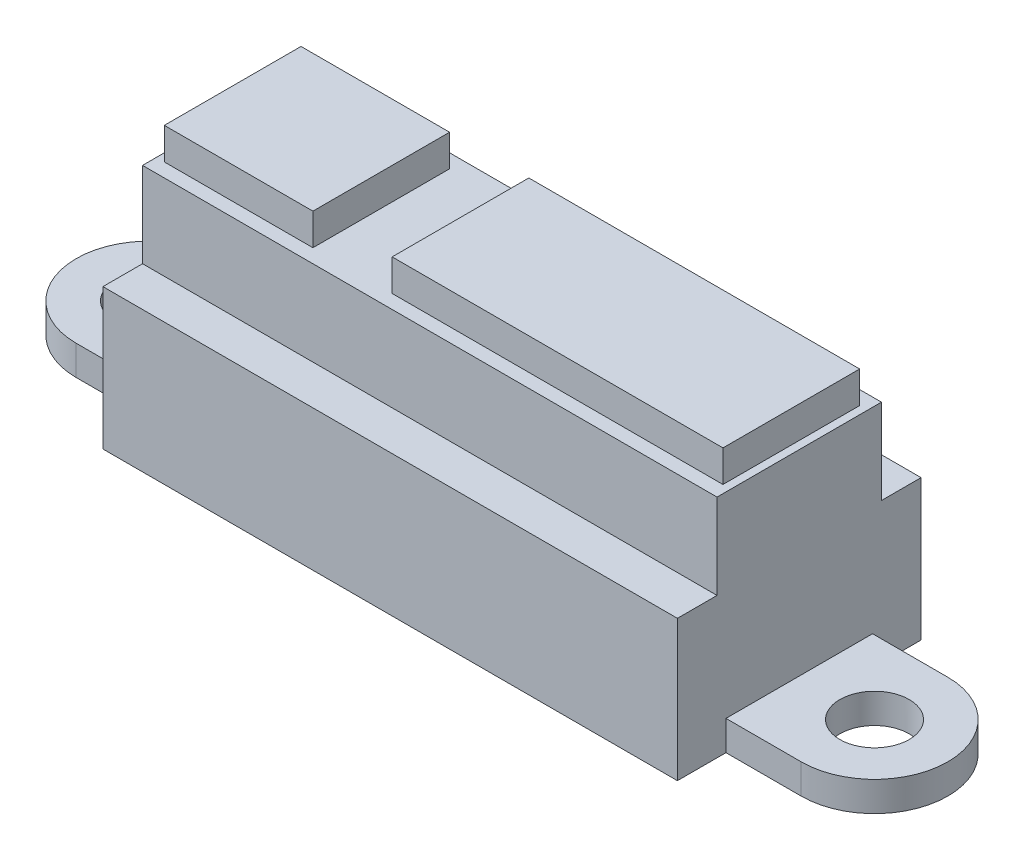
ISO-10303-21;
HEADER;
FILE_DESCRIPTION(('STEP AP214'),'2;1');
FILE_NAME('part.step','',(''),(''),'','','');
FILE_SCHEMA(('AUTOMOTIVE_DESIGN { 1 0 10303 214 1 1 1 1 }'));
ENDSEC;
DATA;
#1=APPLICATION_CONTEXT('core data for automotive mechanical design processes');
#2=APPLICATION_PROTOCOL_DEFINITION('international standard','automotive_design',2000,#1);
#3=PRODUCT_CONTEXT('',#1,'mechanical');
#4=PRODUCT('Part','Part','',(#3));
#5=PRODUCT_RELATED_PRODUCT_CATEGORY('part','',(#4));
#6=PRODUCT_DEFINITION_FORMATION('','',#4);
#7=PRODUCT_DEFINITION_CONTEXT('part definition',#1,'design');
#8=PRODUCT_DEFINITION('design','',#6,#7);
#9=PRODUCT_DEFINITION_SHAPE('','',#8);
#10=(LENGTH_UNIT() NAMED_UNIT(*) SI_UNIT(.MILLI.,.METRE.));
#11=(NAMED_UNIT(*) PLANE_ANGLE_UNIT() SI_UNIT($,.RADIAN.));
#12=(NAMED_UNIT(*) SI_UNIT($,.STERADIAN.) SOLID_ANGLE_UNIT());
#13=UNCERTAINTY_MEASURE_WITH_UNIT(LENGTH_MEASURE(1.E-05),#10,'distance_accuracy_value','');
#14=(GEOMETRIC_REPRESENTATION_CONTEXT(3) GLOBAL_UNCERTAINTY_ASSIGNED_CONTEXT((#13)) GLOBAL_UNIT_ASSIGNED_CONTEXT((#10,
#11,#12)) REPRESENTATION_CONTEXT('',''));
#15=CARTESIAN_POINT('',(0.,0.,0.));
#16=DIRECTION('',(0.,0.,1.));
#17=DIRECTION('',(1.,0.,0.));
#18=AXIS2_PLACEMENT_3D('',#15,#16,#17);
#19=CARTESIAN_POINT('',(22.,0.,12.3));
#20=DIRECTION('',(0.,1.,0.));
#21=DIRECTION('',(-1.,0.,0.));
#22=AXIS2_PLACEMENT_3D('',#19,#20,#21);
#23=PLANE('',#22);
#24=CARTESIAN_POINT('',(18.3,0.,6.15));
#25=DIRECTION('',(0.,1.,0.));
#26=DIRECTION('',(-1.,0.,0.));
#27=AXIS2_PLACEMENT_3D('',#24,#25,#26);
#28=CIRCLE('',#27,1.75);
#29=CARTESIAN_POINT('',(16.55,0.,6.15));
#30=VERTEX_POINT('',#29);
#31=EDGE_CURVE('E319',#30,#30,#28,.F.);
#32=ORIENTED_EDGE('',*,*,#31,.F.);
#33=EDGE_LOOP('',(#32));
#34=FACE_BOUND('',#33,.T.);
#35=DIRECTION('',(-1.,0.,0.));
#36=VECTOR('',#35,1.);
#37=CARTESIAN_POINT('',(22.,0.,9.84999999999999));
#38=LINE('',#37,#36);
#39=CARTESIAN_POINT('',(18.3,0.,9.85));
#40=VERTEX_POINT('',#39);
#41=CARTESIAN_POINT('',(14.5,0.,9.85));
#42=VERTEX_POINT('',#41);
#43=EDGE_CURVE('E320',#40,#42,#38,.T.);
#44=ORIENTED_EDGE('',*,*,#43,.T.);
#45=DIRECTION('',(0.,0.,1.));
#46=VECTOR('',#45,1.);
#47=CARTESIAN_POINT('',(14.5,0.,12.3));
#48=LINE('',#47,#46);
#49=CARTESIAN_POINT('',(14.5,0.,12.3));
#50=VERTEX_POINT('',#49);
#51=EDGE_CURVE('E367',#42,#50,#48,.T.);
#52=ORIENTED_EDGE('',*,*,#51,.T.);
#53=DIRECTION('',(1.,0.,0.));
#54=VECTOR('',#53,1.);
#55=CARTESIAN_POINT('',(-22.,0.,12.3));
#56=LINE('',#55,#54);
#57=CARTESIAN_POINT('',(-14.5,0.,12.3));
#58=VERTEX_POINT('',#57);
#59=EDGE_CURVE('E424',#58,#50,#56,.T.);
#60=ORIENTED_EDGE('',*,*,#59,.F.);
#61=DIRECTION('',(0.,0.,1.));
#62=VECTOR('',#61,1.);
#63=CARTESIAN_POINT('',(-14.5,0.,12.3));
#64=LINE('',#63,#62);
#65=CARTESIAN_POINT('',(-14.5,0.,9.85));
#66=VERTEX_POINT('',#65);
#67=EDGE_CURVE('E414',#66,#58,#64,.T.);
#68=ORIENTED_EDGE('',*,*,#67,.F.);
#69=DIRECTION('',(1.,0.,0.));
#70=VECTOR('',#69,1.);
#71=CARTESIAN_POINT('',(22.,0.,9.85000000000004));
#72=LINE('',#71,#70);
#73=CARTESIAN_POINT('',(-18.3,0.,9.85));
#74=VERTEX_POINT('',#73);
#75=EDGE_CURVE('E309',#74,#66,#72,.T.);
#76=ORIENTED_EDGE('',*,*,#75,.F.);
#77=CARTESIAN_POINT('',(-18.3,0.,6.15));
#78=DIRECTION('',(0.,1.,0.));
#79=DIRECTION('',(-1.,0.,0.));
#80=AXIS2_PLACEMENT_3D('',#77,#78,#79);
#81=CIRCLE('',#80,3.7);
#82=CARTESIAN_POINT('',(-18.3,0.,2.45));
#83=VERTEX_POINT('',#82);
#84=EDGE_CURVE('E311',#83,#74,#81,.T.);
#85=ORIENTED_EDGE('',*,*,#84,.F.);
#86=DIRECTION('',(1.,0.,0.));
#87=VECTOR('',#86,1.);
#88=CARTESIAN_POINT('',(22.,0.,2.4500000000001));
#89=LINE('',#88,#87);
#90=CARTESIAN_POINT('',(-14.5,0.,2.45000000000001));
#91=VERTEX_POINT('',#90);
#92=EDGE_CURVE('E404',#83,#91,#89,.T.);
#93=ORIENTED_EDGE('',*,*,#92,.T.);
#94=DIRECTION('',(0.,0.,-1.));
#95=VECTOR('',#94,1.);
#96=CARTESIAN_POINT('',(-14.5,0.,12.3));
#97=LINE('',#96,#95);
#98=CARTESIAN_POINT('',(-14.5,0.,0.));
#99=VERTEX_POINT('',#98);
#100=EDGE_CURVE('E401',#91,#99,#97,.T.);
#101=ORIENTED_EDGE('',*,*,#100,.T.);
#102=DIRECTION('',(1.,0.,0.));
#103=VECTOR('',#102,1.);
#104=CARTESIAN_POINT('',(22.,0.,0.));
#105=LINE('',#104,#103);
#106=CARTESIAN_POINT('',(14.5,0.,0.));
#107=VERTEX_POINT('',#106);
#108=EDGE_CURVE('E432',#99,#107,#105,.T.);
#109=ORIENTED_EDGE('',*,*,#108,.T.);
#110=DIRECTION('',(0.,0.,-1.));
#111=VECTOR('',#110,1.);
#112=CARTESIAN_POINT('',(14.5,0.,12.3));
#113=LINE('',#112,#111);
#114=CARTESIAN_POINT('',(14.5,0.,2.45));
#115=VERTEX_POINT('',#114);
#116=EDGE_CURVE('E387',#115,#107,#113,.T.);
#117=ORIENTED_EDGE('',*,*,#116,.F.);
#118=DIRECTION('',(-1.,0.,0.));
#119=VECTOR('',#118,1.);
#120=CARTESIAN_POINT('',(22.,0.,2.44999999999998));
#121=LINE('',#120,#119);
#122=CARTESIAN_POINT('',(18.3,0.,2.44999999999999));
#123=VERTEX_POINT('',#122);
#124=EDGE_CURVE('E391',#123,#115,#121,.T.);
#125=ORIENTED_EDGE('',*,*,#124,.F.);
#126=CARTESIAN_POINT('',(18.3,0.,6.15));
#127=DIRECTION('',(0.,1.,0.));
#128=DIRECTION('',(-1.,0.,0.));
#129=AXIS2_PLACEMENT_3D('',#126,#127,#128);
#130=CIRCLE('',#129,3.7);
#131=EDGE_CURVE('E393',#123,#40,#130,.F.);
#132=ORIENTED_EDGE('',*,*,#131,.T.);
#133=EDGE_LOOP('',(#44,#52,#60,#68,#76,#85,#93,#101,#109,#117,#125,#132));
#134=FACE_BOUND('',#133,.T.);
#135=CARTESIAN_POINT('',(-18.3,0.,6.15));
#136=DIRECTION('',(0.,1.,0.));
#137=DIRECTION('',(-1.,0.,0.));
#138=AXIS2_PLACEMENT_3D('',#135,#136,#137);
#139=CIRCLE('',#138,1.75);
#140=CARTESIAN_POINT('',(-20.05,0.,6.15));
#141=VERTEX_POINT('',#140);
#142=EDGE_CURVE('E321',#141,#141,#139,.T.);
#143=ORIENTED_EDGE('',*,*,#142,.T.);
#144=EDGE_LOOP('',(#143));
#145=FACE_BOUND('',#144,.T.);
#146=ADVANCED_FACE('F106',(#34,#134,#145),#23,.F.);
#147=CARTESIAN_POINT('',(14.5,1.50000000000001,12.3));
#148=DIRECTION('',(0.,-1.,0.));
#149=DIRECTION('',(1.,0.,0.));
#150=AXIS2_PLACEMENT_3D('',#147,#148,#149);
#151=PLANE('',#150);
#152=CARTESIAN_POINT('',(18.3,1.50000000000001,6.15));
#153=DIRECTION('',(0.,-1.,0.));
#154=DIRECTION('',(1.,0.,0.));
#155=AXIS2_PLACEMENT_3D('',#152,#153,#154);
#156=CIRCLE('',#155,1.75);
#157=CARTESIAN_POINT('',(20.05,1.50000000000001,6.15));
#158=VERTEX_POINT('',#157);
#159=EDGE_CURVE('E316',#158,#158,#156,.F.);
#160=ORIENTED_EDGE('',*,*,#159,.F.);
#161=EDGE_LOOP('',(#160));
#162=FACE_BOUND('',#161,.T.);
#163=DIRECTION('',(0.,0.,-1.));
#164=VECTOR('',#163,1.);
#165=CARTESIAN_POINT('',(14.5,1.50000000000001,12.3));
#166=LINE('',#165,#164);
#167=CARTESIAN_POINT('',(14.5,1.50000000000001,9.85));
#168=VERTEX_POINT('',#167);
#169=CARTESIAN_POINT('',(14.5,1.50000000000001,2.45));
#170=VERTEX_POINT('',#169);
#171=EDGE_CURVE('E294',#168,#170,#166,.T.);
#172=ORIENTED_EDGE('',*,*,#171,.F.);
#173=DIRECTION('',(1.,0.,0.));
#174=VECTOR('',#173,1.);
#175=CARTESIAN_POINT('',(14.5,1.50000000000001,9.85));
#176=LINE('',#175,#174);
#177=CARTESIAN_POINT('',(18.3,1.5,9.85));
#178=VERTEX_POINT('',#177);
#179=EDGE_CURVE('E372',#168,#178,#176,.T.);
#180=ORIENTED_EDGE('',*,*,#179,.T.);
#181=CARTESIAN_POINT('',(18.3,1.50000000000001,6.15));
#182=DIRECTION('',(0.,-1.,0.));
#183=DIRECTION('',(1.,0.,0.));
#184=AXIS2_PLACEMENT_3D('',#181,#182,#183);
#185=CIRCLE('',#184,3.7);
#186=CARTESIAN_POINT('',(18.3,1.5,2.44999999999999));
#187=VERTEX_POINT('',#186);
#188=EDGE_CURVE('E313',#178,#187,#185,.F.);
#189=ORIENTED_EDGE('',*,*,#188,.T.);
#190=DIRECTION('',(1.,0.,0.));
#191=VECTOR('',#190,1.);
#192=CARTESIAN_POINT('',(14.5,1.50000000000001,2.45));
#193=LINE('',#192,#191);
#194=EDGE_CURVE('E389',#170,#187,#193,.T.);
#195=ORIENTED_EDGE('',*,*,#194,.F.);
#196=EDGE_LOOP('',(#172,#180,#189,#195));
#197=FACE_BOUND('',#196,.T.);
#198=ADVANCED_FACE('F448',(#162,#197),#151,.F.);
#199=CARTESIAN_POINT('',(0.,0.,0.));
#200=DIRECTION('',(0.,0.,1.));
#201=DIRECTION('',(1.,0.,0.));
#202=AXIS2_PLACEMENT_3D('',#199,#200,#201);
#203=PLANE('',#202);
#204=DIRECTION('',(0.,-1.,0.));
#205=VECTOR('',#204,1.);
#206=CARTESIAN_POINT('',(-14.5,11.4,0.));
#207=LINE('',#206,#205);
#208=CARTESIAN_POINT('',(-14.5,7.1,0.));
#209=VERTEX_POINT('',#208);
#210=EDGE_CURVE('E340',#209,#99,#207,.T.);
#211=ORIENTED_EDGE('',*,*,#210,.F.);
#212=DIRECTION('',(-1.,0.,0.));
#213=VECTOR('',#212,1.);
#214=CARTESIAN_POINT('',(17.8,7.1,0.));
#215=LINE('',#214,#213);
#216=CARTESIAN_POINT('',(14.5,7.1,0.));
#217=VERTEX_POINT('',#216);
#218=EDGE_CURVE('E335',#217,#209,#215,.T.);
#219=ORIENTED_EDGE('',*,*,#218,.F.);
#220=DIRECTION('',(0.,1.,0.));
#221=VECTOR('',#220,1.);
#222=CARTESIAN_POINT('',(14.5,11.4,0.));
#223=LINE('',#222,#221);
#224=EDGE_CURVE('E129',#107,#217,#223,.T.);
#225=ORIENTED_EDGE('',*,*,#224,.F.);
#226=ORIENTED_EDGE('',*,*,#108,.F.);
#227=EDGE_LOOP('',(#211,#219,#225,#226));
#228=FACE_BOUND('',#227,.T.);
#229=ADVANCED_FACE('F339',(#228),#203,.F.);
#230=CARTESIAN_POINT('',(-14.5,1.5,12.3));
#231=DIRECTION('',(0.,-1.,0.));
#232=DIRECTION('',(1.,0.,0.));
#233=AXIS2_PLACEMENT_3D('',#230,#231,#232);
#234=PLANE('',#233);
#235=CARTESIAN_POINT('',(-18.3,1.5,6.15));
#236=DIRECTION('',(0.,-1.,0.));
#237=DIRECTION('',(1.,0.,0.));
#238=AXIS2_PLACEMENT_3D('',#235,#236,#237);
#239=CIRCLE('',#238,1.75);
#240=CARTESIAN_POINT('',(-16.55,1.5,6.15));
#241=VERTEX_POINT('',#240);
#242=EDGE_CURVE('E324',#241,#241,#239,.T.);
#243=ORIENTED_EDGE('',*,*,#242,.T.);
#244=EDGE_LOOP('',(#243));
#245=FACE_BOUND('',#244,.T.);
#246=DIRECTION('',(-1.,0.,0.));
#247=VECTOR('',#246,1.);
#248=CARTESIAN_POINT('',(-14.5,1.5,2.45000000000001));
#249=LINE('',#248,#247);
#250=CARTESIAN_POINT('',(-14.5,1.5,2.45000000000001));
#251=VERTEX_POINT('',#250);
#252=CARTESIAN_POINT('',(-18.3,1.5,2.45));
#253=VERTEX_POINT('',#252);
#254=EDGE_CURVE('E407',#251,#253,#249,.T.);
#255=ORIENTED_EDGE('',*,*,#254,.T.);
#256=CARTESIAN_POINT('',(-18.3,1.5,6.15));
#257=DIRECTION('',(0.,-1.,0.));
#258=DIRECTION('',(1.,0.,0.));
#259=AXIS2_PLACEMENT_3D('',#256,#257,#258);
#260=CIRCLE('',#259,3.7);
#261=CARTESIAN_POINT('',(-18.3,1.5,9.85));
#262=VERTEX_POINT('',#261);
#263=EDGE_CURVE('E420',#262,#253,#260,.T.);
#264=ORIENTED_EDGE('',*,*,#263,.F.);
#265=DIRECTION('',(-1.,0.,0.));
#266=VECTOR('',#265,1.);
#267=CARTESIAN_POINT('',(-14.5,1.5,9.85));
#268=LINE('',#267,#266);
#269=CARTESIAN_POINT('',(-14.5,1.5,9.85));
#270=VERTEX_POINT('',#269);
#271=EDGE_CURVE('E418',#270,#262,#268,.T.);
#272=ORIENTED_EDGE('',*,*,#271,.F.);
#273=DIRECTION('',(0.,0.,-1.));
#274=VECTOR('',#273,1.);
#275=CARTESIAN_POINT('',(-14.5,1.5,12.3));
#276=LINE('',#275,#274);
#277=EDGE_CURVE('E289',#270,#251,#276,.T.);
#278=ORIENTED_EDGE('',*,*,#277,.T.);
#279=EDGE_LOOP('',(#255,#264,#272,#278));
#280=FACE_BOUND('',#279,.T.);
#281=ADVANCED_FACE('F466',(#245,#280),#234,.F.);
#282=CARTESIAN_POINT('',(0.,0.,12.3));
#283=DIRECTION('',(0.,0.,1.));
#284=DIRECTION('',(1.,0.,0.));
#285=AXIS2_PLACEMENT_3D('',#282,#283,#284);
#286=PLANE('',#285);
#287=DIRECTION('',(-1.,0.,0.));
#288=VECTOR('',#287,1.);
#289=CARTESIAN_POINT('',(17.8,7.10000000000001,12.3));
#290=LINE('',#289,#288);
#291=CARTESIAN_POINT('',(14.5,7.10000000000001,12.3));
#292=VERTEX_POINT('',#291);
#293=CARTESIAN_POINT('',(-14.5,7.10000000000001,12.3));
#294=VERTEX_POINT('',#293);
#295=EDGE_CURVE('E475',#292,#294,#290,.T.);
#296=ORIENTED_EDGE('',*,*,#295,.T.);
#297=DIRECTION('',(0.,-1.,0.));
#298=VECTOR('',#297,1.);
#299=CARTESIAN_POINT('',(-14.5,11.4,12.3));
#300=LINE('',#299,#298);
#301=EDGE_CURVE('E422',#294,#58,#300,.T.);
#302=ORIENTED_EDGE('',*,*,#301,.T.);
#303=ORIENTED_EDGE('',*,*,#59,.T.);
#304=DIRECTION('',(0.,1.,0.));
#305=VECTOR('',#304,1.);
#306=CARTESIAN_POINT('',(14.5,11.4,12.3));
#307=LINE('',#306,#305);
#308=EDGE_CURVE('E427',#50,#292,#307,.T.);
#309=ORIENTED_EDGE('',*,*,#308,.T.);
#310=EDGE_LOOP('',(#296,#302,#303,#309));
#311=FACE_BOUND('',#310,.T.);
#312=ADVANCED_FACE('F474',(#311),#286,.T.);
#313=CARTESIAN_POINT('',(14.1,13.,12.3));
#314=DIRECTION('',(-1.,0.,0.));
#315=DIRECTION('',(0.,0.,1.));
#316=AXIS2_PLACEMENT_3D('',#313,#314,#315);
#317=PLANE('',#316);
#318=DIRECTION('',(0.,0.,-1.));
#319=VECTOR('',#318,1.);
#320=CARTESIAN_POINT('',(14.1,13.,12.3));
#321=LINE('',#320,#319);
#322=CARTESIAN_POINT('',(14.1,13.,9.6));
#323=VERTEX_POINT('',#322);
#324=CARTESIAN_POINT('',(14.1,13.,2.7));
#325=VERTEX_POINT('',#324);
#326=EDGE_CURVE('E307',#323,#325,#321,.T.);
#327=ORIENTED_EDGE('',*,*,#326,.F.);
#328=DIRECTION('',(0.,-1.,0.));
#329=VECTOR('',#328,1.);
#330=CARTESIAN_POINT('',(14.1,13.,9.6));
#331=LINE('',#330,#329);
#332=CARTESIAN_POINT('',(14.1,11.4,9.6));
#333=VERTEX_POINT('',#332);
#334=EDGE_CURVE('E498',#323,#333,#331,.T.);
#335=ORIENTED_EDGE('',*,*,#334,.T.);
#336=DIRECTION('',(0.,0.,-1.));
#337=VECTOR('',#336,1.);
#338=CARTESIAN_POINT('',(14.1,11.4,12.3));
#339=LINE('',#338,#337);
#340=CARTESIAN_POINT('',(14.1,11.4,2.7));
#341=VERTEX_POINT('',#340);
#342=EDGE_CURVE('E430',#333,#341,#339,.T.);
#343=ORIENTED_EDGE('',*,*,#342,.T.);
#344=DIRECTION('',(0.,1.,0.));
#345=VECTOR('',#344,1.);
#346=CARTESIAN_POINT('',(14.1,13.,2.7));
#347=LINE('',#346,#345);
#348=EDGE_CURVE('E360',#341,#325,#347,.T.);
#349=ORIENTED_EDGE('',*,*,#348,.T.);
#350=EDGE_LOOP('',(#327,#335,#343,#349));
#351=FACE_BOUND('',#350,.T.);
#352=ADVANCED_FACE('F108',(#351),#317,.F.);
#353=CARTESIAN_POINT('',(-2.6,13.,12.3));
#354=DIRECTION('',(0.,-1.,0.));
#355=DIRECTION('',(1.,0.,0.));
#356=AXIS2_PLACEMENT_3D('',#353,#354,#355);
#357=PLANE('',#356);
#358=DIRECTION('',(0.,0.,-1.));
#359=VECTOR('',#358,1.);
#360=CARTESIAN_POINT('',(-2.6,13.,12.3));
#361=LINE('',#360,#359);
#362=CARTESIAN_POINT('',(-2.6,13.,9.6));
#363=VERTEX_POINT('',#362);
#364=CARTESIAN_POINT('',(-2.6,13.,2.7));
#365=VERTEX_POINT('',#364);
#366=EDGE_CURVE('E305',#363,#365,#361,.T.);
#367=ORIENTED_EDGE('',*,*,#366,.F.);
#368=DIRECTION('',(-1.,0.,0.));
#369=VECTOR('',#368,1.);
#370=CARTESIAN_POINT('',(17.8,13.,9.6));
#371=LINE('',#370,#369);
#372=EDGE_CURVE('E490',#323,#363,#371,.T.);
#373=ORIENTED_EDGE('',*,*,#372,.F.);
#374=ORIENTED_EDGE('',*,*,#326,.T.);
#375=DIRECTION('',(-1.,0.,0.));
#376=VECTOR('',#375,1.);
#377=CARTESIAN_POINT('',(17.8,13.,2.7));
#378=LINE('',#377,#376);
#379=EDGE_CURVE('E351',#325,#365,#378,.T.);
#380=ORIENTED_EDGE('',*,*,#379,.T.);
#381=EDGE_LOOP('',(#367,#373,#374,#380));
#382=FACE_BOUND('',#381,.T.);
#383=ADVANCED_FACE('F527',(#382),#357,.F.);
#384=CARTESIAN_POINT('',(-2.6,11.4,12.3));
#385=DIRECTION('',(1.,0.,0.));
#386=DIRECTION('',(0.,0.,-1.));
#387=AXIS2_PLACEMENT_3D('',#384,#385,#386);
#388=PLANE('',#387);
#389=DIRECTION('',(0.,0.,-1.));
#390=VECTOR('',#389,1.);
#391=CARTESIAN_POINT('',(-2.6,11.4,12.3));
#392=LINE('',#391,#390);
#393=CARTESIAN_POINT('',(-2.6,11.4,9.6));
#394=VERTEX_POINT('',#393);
#395=CARTESIAN_POINT('',(-2.6,11.4,2.7));
#396=VERTEX_POINT('',#395);
#397=EDGE_CURVE('E303',#394,#396,#392,.T.);
#398=ORIENTED_EDGE('',*,*,#397,.F.);
#399=DIRECTION('',(0.,1.,0.));
#400=VECTOR('',#399,1.);
#401=CARTESIAN_POINT('',(-2.6,11.4,9.6));
#402=LINE('',#401,#400);
#403=EDGE_CURVE('E495',#394,#363,#402,.T.);
#404=ORIENTED_EDGE('',*,*,#403,.T.);
#405=ORIENTED_EDGE('',*,*,#366,.T.);
#406=DIRECTION('',(0.,-1.,0.));
#407=VECTOR('',#406,1.);
#408=CARTESIAN_POINT('',(-2.6,11.4,2.7));
#409=LINE('',#408,#407);
#410=EDGE_CURVE('E357',#365,#396,#409,.T.);
#411=ORIENTED_EDGE('',*,*,#410,.T.);
#412=EDGE_LOOP('',(#398,#404,#405,#411));
#413=FACE_BOUND('',#412,.T.);
#414=ADVANCED_FACE('F523',(#413),#388,.F.);
#415=CARTESIAN_POINT('',(-6.6,13.,12.3));
#416=DIRECTION('',(-1.,0.,0.));
#417=DIRECTION('',(0.,-1.,0.));
#418=AXIS2_PLACEMENT_3D('',#415,#416,#417);
#419=PLANE('',#418);
#420=DIRECTION('',(0.,0.,-1.));
#421=VECTOR('',#420,1.);
#422=CARTESIAN_POINT('',(-6.6,13.,12.3));
#423=LINE('',#422,#421);
#424=CARTESIAN_POINT('',(-6.6,13.,9.6));
#425=VERTEX_POINT('',#424);
#426=CARTESIAN_POINT('',(-6.6,13.,2.7));
#427=VERTEX_POINT('',#426);
#428=EDGE_CURVE('E299',#425,#427,#423,.T.);
#429=ORIENTED_EDGE('',*,*,#428,.F.);
#430=DIRECTION('',(0.,-1.,0.));
#431=VECTOR('',#430,1.);
#432=CARTESIAN_POINT('',(-6.6,13.,9.6));
#433=LINE('',#432,#431);
#434=CARTESIAN_POINT('',(-6.6,11.4,9.6));
#435=VERTEX_POINT('',#434);
#436=EDGE_CURVE('E481',#425,#435,#433,.T.);
#437=ORIENTED_EDGE('',*,*,#436,.T.);
#438=DIRECTION('',(0.,0.,-1.));
#439=VECTOR('',#438,1.);
#440=CARTESIAN_POINT('',(-6.6,11.4,12.3));
#441=LINE('',#440,#439);
#442=CARTESIAN_POINT('',(-6.6,11.4,2.7));
#443=VERTEX_POINT('',#442);
#444=EDGE_CURVE('E301',#435,#443,#441,.T.);
#445=ORIENTED_EDGE('',*,*,#444,.T.);
#446=DIRECTION('',(0.,1.,0.));
#447=VECTOR('',#446,1.);
#448=CARTESIAN_POINT('',(-6.6,13.,2.7));
#449=LINE('',#448,#447);
#450=EDGE_CURVE('E354',#443,#427,#449,.T.);
#451=ORIENTED_EDGE('',*,*,#450,.T.);
#452=EDGE_LOOP('',(#429,#437,#445,#451));
#453=FACE_BOUND('',#452,.T.);
#454=ADVANCED_FACE('F568',(#453),#419,.F.);
#455=CARTESIAN_POINT('',(-14.1,13.,12.3));
#456=DIRECTION('',(0.,-1.,0.));
#457=DIRECTION('',(0.,0.,-1.));
#458=AXIS2_PLACEMENT_3D('',#455,#456,#457);
#459=PLANE('',#458);
#460=DIRECTION('',(0.,0.,-1.));
#461=VECTOR('',#460,1.);
#462=CARTESIAN_POINT('',(-14.1,13.,12.3));
#463=LINE('',#462,#461);
#464=CARTESIAN_POINT('',(-14.1,13.,9.6));
#465=VERTEX_POINT('',#464);
#466=CARTESIAN_POINT('',(-14.1,13.,2.7));
#467=VERTEX_POINT('',#466);
#468=EDGE_CURVE('E291',#465,#467,#463,.T.);
#469=ORIENTED_EDGE('',*,*,#468,.F.);
#470=EDGE_CURVE('E491',#425,#465,#371,.T.);
#471=ORIENTED_EDGE('',*,*,#470,.F.);
#472=ORIENTED_EDGE('',*,*,#428,.T.);
#473=EDGE_CURVE('E503',#427,#467,#378,.T.);
#474=ORIENTED_EDGE('',*,*,#473,.T.);
#475=EDGE_LOOP('',(#469,#471,#472,#474));
#476=FACE_BOUND('',#475,.T.);
#477=ADVANCED_FACE('F564',(#476),#459,.F.);
#478=CARTESIAN_POINT('',(-14.1,13.,12.3));
#479=DIRECTION('',(1.,0.,0.));
#480=DIRECTION('',(0.,0.,-1.));
#481=AXIS2_PLACEMENT_3D('',#478,#479,#480);
#482=PLANE('',#481);
#483=DIRECTION('',(0.,0.,-1.));
#484=VECTOR('',#483,1.);
#485=CARTESIAN_POINT('',(-14.1,11.4,12.3));
#486=LINE('',#485,#484);
#487=CARTESIAN_POINT('',(-14.1,11.4,9.6));
#488=VERTEX_POINT('',#487);
#489=CARTESIAN_POINT('',(-14.1,11.4,2.7));
#490=VERTEX_POINT('',#489);
#491=EDGE_CURVE('E288',#488,#490,#486,.T.);
#492=ORIENTED_EDGE('',*,*,#491,.F.);
#493=DIRECTION('',(0.,1.,0.));
#494=VECTOR('',#493,1.);
#495=CARTESIAN_POINT('',(-14.1,13.,9.6));
#496=LINE('',#495,#494);
#497=EDGE_CURVE('E477',#488,#465,#496,.T.);
#498=ORIENTED_EDGE('',*,*,#497,.T.);
#499=ORIENTED_EDGE('',*,*,#468,.T.);
#500=DIRECTION('',(0.,-1.,0.));
#501=VECTOR('',#500,1.);
#502=CARTESIAN_POINT('',(-14.1,13.,2.7));
#503=LINE('',#502,#501);
#504=EDGE_CURVE('E350',#467,#490,#503,.T.);
#505=ORIENTED_EDGE('',*,*,#504,.T.);
#506=EDGE_LOOP('',(#492,#498,#499,#505));
#507=FACE_BOUND('',#506,.T.);
#508=ADVANCED_FACE('F561',(#507),#482,.F.);
#509=CARTESIAN_POINT('',(-14.5,11.4,12.3));
#510=DIRECTION('',(1.,0.,0.));
#511=DIRECTION('',(0.,0.,-1.));
#512=AXIS2_PLACEMENT_3D('',#509,#510,#511);
#513=PLANE('',#512);
#514=ORIENTED_EDGE('',*,*,#301,.F.);
#515=DIRECTION('',(0.,0.,1.));
#516=VECTOR('',#515,1.);
#517=CARTESIAN_POINT('',(-14.5,7.10000000000001,10.3));
#518=LINE('',#517,#516);
#519=CARTESIAN_POINT('',(-14.5,7.10000000000001,10.3));
#520=VERTEX_POINT('',#519);
#521=EDGE_CURVE('E282',#520,#294,#518,.T.);
#522=ORIENTED_EDGE('',*,*,#521,.F.);
#523=DIRECTION('',(0.,-1.,0.));
#524=VECTOR('',#523,1.);
#525=CARTESIAN_POINT('',(-14.5,11.4,10.3));
#526=LINE('',#525,#524);
#527=CARTESIAN_POINT('',(-14.5,11.4,10.3));
#528=VERTEX_POINT('',#527);
#529=EDGE_CURVE('E270',#528,#520,#526,.T.);
#530=ORIENTED_EDGE('',*,*,#529,.F.);
#531=DIRECTION('',(0.,0.,-1.));
#532=VECTOR('',#531,1.);
#533=CARTESIAN_POINT('',(-14.5,11.4,12.3));
#534=LINE('',#533,#532);
#535=CARTESIAN_POINT('',(-14.5,11.4,2.));
#536=VERTEX_POINT('',#535);
#537=EDGE_CURVE('E280',#528,#536,#534,.T.);
#538=ORIENTED_EDGE('',*,*,#537,.T.);
#539=DIRECTION('',(0.,1.,0.));
#540=VECTOR('',#539,1.);
#541=CARTESIAN_POINT('',(-14.5,11.4,2.));
#542=LINE('',#541,#540);
#543=CARTESIAN_POINT('',(-14.5,7.1,2.));
#544=VERTEX_POINT('',#543);
#545=EDGE_CURVE('E341',#544,#536,#542,.T.);
#546=ORIENTED_EDGE('',*,*,#545,.F.);
#547=DIRECTION('',(0.,0.,1.));
#548=VECTOR('',#547,1.);
#549=CARTESIAN_POINT('',(-14.5,7.1,2.));
#550=LINE('',#549,#548);
#551=EDGE_CURVE('E345',#209,#544,#550,.T.);
#552=ORIENTED_EDGE('',*,*,#551,.F.);
#553=ORIENTED_EDGE('',*,*,#210,.T.);
#554=ORIENTED_EDGE('',*,*,#100,.F.);
#555=DIRECTION('',(0.,1.,0.));
#556=VECTOR('',#555,1.);
#557=CARTESIAN_POINT('',(-14.5,-9.3,2.45000000000001));
#558=LINE('',#557,#556);
#559=EDGE_CURVE('E398',#91,#251,#558,.T.);
#560=ORIENTED_EDGE('',*,*,#559,.T.);
#561=ORIENTED_EDGE('',*,*,#277,.F.);
#562=DIRECTION('',(0.,1.,0.));
#563=VECTOR('',#562,1.);
#564=CARTESIAN_POINT('',(-14.5,-9.3,9.85));
#565=LINE('',#564,#563);
#566=EDGE_CURVE('E410',#66,#270,#565,.T.);
#567=ORIENTED_EDGE('',*,*,#566,.F.);
#568=ORIENTED_EDGE('',*,*,#67,.T.);
#569=EDGE_LOOP('',(#514,#522,#530,#538,#546,#552,#553,#554,#560,#561,#567,#568));
#570=FACE_BOUND('',#569,.T.);
#571=ADVANCED_FACE('F278',(#570),#513,.F.);
#572=CARTESIAN_POINT('',(14.5,11.4,12.3));
#573=DIRECTION('',(-1.,0.,0.));
#574=DIRECTION('',(0.,-1.,0.));
#575=AXIS2_PLACEMENT_3D('',#572,#573,#574);
#576=PLANE('',#575);
#577=DIRECTION('',(0.,-1.,0.));
#578=VECTOR('',#577,1.);
#579=CARTESIAN_POINT('',(14.5,11.4,10.3));
#580=LINE('',#579,#578);
#581=CARTESIAN_POINT('',(14.5,11.4,10.3));
#582=VERTEX_POINT('',#581);
#583=CARTESIAN_POINT('',(14.5,7.10000000000001,10.3));
#584=VERTEX_POINT('',#583);
#585=EDGE_CURVE('E121',#582,#584,#580,.T.);
#586=ORIENTED_EDGE('',*,*,#585,.T.);
#587=DIRECTION('',(0.,0.,1.));
#588=VECTOR('',#587,1.);
#589=CARTESIAN_POINT('',(14.5,7.10000000000001,12.3));
#590=LINE('',#589,#588);
#591=EDGE_CURVE('E12',#584,#292,#590,.T.);
#592=ORIENTED_EDGE('',*,*,#591,.T.);
#593=ORIENTED_EDGE('',*,*,#308,.F.);
#594=ORIENTED_EDGE('',*,*,#51,.F.);
#595=DIRECTION('',(0.,1.,0.));
#596=VECTOR('',#595,1.);
#597=CARTESIAN_POINT('',(14.5,-9.3,9.85));
#598=LINE('',#597,#596);
#599=EDGE_CURVE('E364',#42,#168,#598,.T.);
#600=ORIENTED_EDGE('',*,*,#599,.T.);
#601=ORIENTED_EDGE('',*,*,#171,.T.);
#602=DIRECTION('',(0.,1.,0.));
#603=VECTOR('',#602,1.);
#604=CARTESIAN_POINT('',(14.5,-9.3,2.45));
#605=LINE('',#604,#603);
#606=EDGE_CURVE('E384',#115,#170,#605,.T.);
#607=ORIENTED_EDGE('',*,*,#606,.F.);
#608=ORIENTED_EDGE('',*,*,#116,.T.);
#609=ORIENTED_EDGE('',*,*,#224,.T.);
#610=DIRECTION('',(0.,0.,1.));
#611=VECTOR('',#610,1.);
#612=CARTESIAN_POINT('',(14.5,7.1,12.3));
#613=LINE('',#612,#611);
#614=CARTESIAN_POINT('',(14.5,7.1,2.));
#615=VERTEX_POINT('',#614);
#616=EDGE_CURVE('E275',#217,#615,#613,.T.);
#617=ORIENTED_EDGE('',*,*,#616,.T.);
#618=DIRECTION('',(0.,1.,0.));
#619=VECTOR('',#618,1.);
#620=CARTESIAN_POINT('',(14.5,11.4,2.));
#621=LINE('',#620,#619);
#622=CARTESIAN_POINT('',(14.5,11.4,2.));
#623=VERTEX_POINT('',#622);
#624=EDGE_CURVE('E330',#615,#623,#621,.T.);
#625=ORIENTED_EDGE('',*,*,#624,.T.);
#626=DIRECTION('',(0.,0.,-1.));
#627=VECTOR('',#626,1.);
#628=CARTESIAN_POINT('',(14.5,11.4,12.3));
#629=LINE('',#628,#627);
#630=EDGE_CURVE('E437',#582,#623,#629,.T.);
#631=ORIENTED_EDGE('',*,*,#630,.F.);
#632=EDGE_LOOP('',(#586,#592,#593,#594,#600,#601,#607,#608,#609,#617,#625,#631));
#633=FACE_BOUND('',#632,.T.);
#634=ADVANCED_FACE('F329',(#633),#576,.F.);
#635=CARTESIAN_POINT('',(14.1,11.4,12.3));
#636=DIRECTION('',(0.,-1.,0.));
#637=DIRECTION('',(1.,0.,0.));
#638=AXIS2_PLACEMENT_3D('',#635,#636,#637);
#639=PLANE('',#638);
#640=ORIENTED_EDGE('',*,*,#342,.F.);
#641=DIRECTION('',(-1.,0.,0.));
#642=VECTOR('',#641,1.);
#643=CARTESIAN_POINT('',(17.8,11.4,9.6));
#644=LINE('',#643,#642);
#645=EDGE_CURVE('E483',#333,#394,#644,.T.);
#646=ORIENTED_EDGE('',*,*,#645,.T.);
#647=ORIENTED_EDGE('',*,*,#397,.T.);
#648=DIRECTION('',(-1.,0.,0.));
#649=VECTOR('',#648,1.);
#650=CARTESIAN_POINT('',(17.8,11.4,2.7));
#651=LINE('',#650,#649);
#652=EDGE_CURVE('E505',#341,#396,#651,.T.);
#653=ORIENTED_EDGE('',*,*,#652,.F.);
#654=EDGE_LOOP('',(#640,#646,#647,#653));
#655=FACE_BOUND('',#654,.T.);
#656=ORIENTED_EDGE('',*,*,#444,.F.);
#657=EDGE_CURVE('E487',#435,#488,#644,.T.);
#658=ORIENTED_EDGE('',*,*,#657,.T.);
#659=ORIENTED_EDGE('',*,*,#491,.T.);
#660=EDGE_CURVE('E343',#443,#490,#651,.T.);
#661=ORIENTED_EDGE('',*,*,#660,.F.);
#662=EDGE_LOOP('',(#656,#658,#659,#661));
#663=FACE_BOUND('',#662,.T.);
#664=DIRECTION('',(-1.,0.,0.));
#665=VECTOR('',#664,1.);
#666=CARTESIAN_POINT('',(14.1,11.4,2.));
#667=LINE('',#666,#665);
#668=EDGE_CURVE('E286',#623,#536,#667,.T.);
#669=ORIENTED_EDGE('',*,*,#668,.T.);
#670=ORIENTED_EDGE('',*,*,#537,.F.);
#671=DIRECTION('',(1.,0.,0.));
#672=VECTOR('',#671,1.);
#673=CARTESIAN_POINT('',(14.1,11.4,10.3));
#674=LINE('',#673,#672);
#675=EDGE_CURVE('E114',#528,#582,#674,.T.);
#676=ORIENTED_EDGE('',*,*,#675,.T.);
#677=ORIENTED_EDGE('',*,*,#630,.T.);
#678=EDGE_LOOP('',(#669,#670,#676,#677));
#679=FACE_BOUND('',#678,.T.);
#680=ADVANCED_FACE('F284',(#655,#663,#679),#639,.F.);
#681=CARTESIAN_POINT('',(-18.3,-9.3,6.15));
#682=DIRECTION('',(0.,1.,0.));
#683=DIRECTION('',(-1.,0.,0.));
#684=AXIS2_PLACEMENT_3D('',#681,#682,#683);
#685=CYLINDRICAL_SURFACE('',#684,3.7);
#686=ORIENTED_EDGE('',*,*,#263,.T.);
#687=DIRECTION('',(0.,1.,0.));
#688=VECTOR('',#687,1.);
#689=CARTESIAN_POINT('',(-18.3,-9.3,2.45));
#690=LINE('',#689,#688);
#691=EDGE_CURVE('E395',#83,#253,#690,.T.);
#692=ORIENTED_EDGE('',*,*,#691,.F.);
#693=ORIENTED_EDGE('',*,*,#84,.T.);
#694=DIRECTION('',(0.,1.,0.));
#695=VECTOR('',#694,1.);
#696=CARTESIAN_POINT('',(-18.3,-9.3,9.85));
#697=LINE('',#696,#695);
#698=EDGE_CURVE('E411',#74,#262,#697,.T.);
#699=ORIENTED_EDGE('',*,*,#698,.T.);
#700=EDGE_LOOP('',(#686,#692,#693,#699));
#701=FACE_BOUND('',#700,.T.);
#702=ADVANCED_FACE('F586',(#701),#685,.T.);
#703=CARTESIAN_POINT('',(0.,-9.3,9.85000000000002));
#704=DIRECTION('',(0.,0.,1.));
#705=DIRECTION('',(1.,0.,0.));
#706=AXIS2_PLACEMENT_3D('',#703,#704,#705);
#707=PLANE('',#706);
#708=ORIENTED_EDGE('',*,*,#271,.T.);
#709=ORIENTED_EDGE('',*,*,#698,.F.);
#710=ORIENTED_EDGE('',*,*,#75,.T.);
#711=ORIENTED_EDGE('',*,*,#566,.T.);
#712=EDGE_LOOP('',(#708,#709,#710,#711));
#713=FACE_BOUND('',#712,.T.);
#714=ADVANCED_FACE('F607',(#713),#707,.T.);
#715=CARTESIAN_POINT('',(0.,-9.3,2.45000000000004));
#716=DIRECTION('',(0.,0.,1.));
#717=DIRECTION('',(1.,0.,0.));
#718=AXIS2_PLACEMENT_3D('',#715,#716,#717);
#719=PLANE('',#718);
#720=ORIENTED_EDGE('',*,*,#559,.F.);
#721=ORIENTED_EDGE('',*,*,#92,.F.);
#722=ORIENTED_EDGE('',*,*,#691,.T.);
#723=ORIENTED_EDGE('',*,*,#254,.F.);
#724=EDGE_LOOP('',(#720,#721,#722,#723));
#725=FACE_BOUND('',#724,.T.);
#726=ADVANCED_FACE('F462',(#725),#719,.F.);
#727=CARTESIAN_POINT('',(18.3,-9.3,6.15));
#728=DIRECTION('',(0.,1.,0.));
#729=DIRECTION('',(-1.,0.,0.));
#730=AXIS2_PLACEMENT_3D('',#727,#728,#729);
#731=CYLINDRICAL_SURFACE('',#730,3.7);
#732=DIRECTION('',(0.,1.,0.));
#733=VECTOR('',#732,1.);
#734=CARTESIAN_POINT('',(18.3,-9.3,2.44999999999999));
#735=LINE('',#734,#733);
#736=EDGE_CURVE('E381',#123,#187,#735,.T.);
#737=ORIENTED_EDGE('',*,*,#736,.T.);
#738=ORIENTED_EDGE('',*,*,#188,.F.);
#739=DIRECTION('',(0.,1.,0.));
#740=VECTOR('',#739,1.);
#741=CARTESIAN_POINT('',(18.3,-9.3,9.85));
#742=LINE('',#741,#740);
#743=EDGE_CURVE('E363',#40,#178,#742,.T.);
#744=ORIENTED_EDGE('',*,*,#743,.F.);
#745=ORIENTED_EDGE('',*,*,#131,.F.);
#746=EDGE_LOOP('',(#737,#738,#744,#745));
#747=FACE_BOUND('',#746,.T.);
#748=ADVANCED_FACE('F451',(#747),#731,.T.);
#749=CARTESIAN_POINT('',(0.,-9.3,2.45000000000005));
#750=DIRECTION('',(0.,0.,-1.));
#751=DIRECTION('',(-1.,0.,0.));
#752=AXIS2_PLACEMENT_3D('',#749,#750,#751);
#753=PLANE('',#752);
#754=ORIENTED_EDGE('',*,*,#124,.T.);
#755=ORIENTED_EDGE('',*,*,#606,.T.);
#756=ORIENTED_EDGE('',*,*,#194,.T.);
#757=ORIENTED_EDGE('',*,*,#736,.F.);
#758=EDGE_LOOP('',(#754,#755,#756,#757));
#759=FACE_BOUND('',#758,.T.);
#760=ADVANCED_FACE('F445',(#759),#753,.T.);
#761=CARTESIAN_POINT('',(0.,-9.3,9.85));
#762=DIRECTION('',(0.,0.,-1.));
#763=DIRECTION('',(-1.,0.,0.));
#764=AXIS2_PLACEMENT_3D('',#761,#762,#763);
#765=PLANE('',#764);
#766=ORIENTED_EDGE('',*,*,#743,.T.);
#767=ORIENTED_EDGE('',*,*,#179,.F.);
#768=ORIENTED_EDGE('',*,*,#599,.F.);
#769=ORIENTED_EDGE('',*,*,#43,.F.);
#770=EDGE_LOOP('',(#766,#767,#768,#769));
#771=FACE_BOUND('',#770,.T.);
#772=ADVANCED_FACE('F454',(#771),#765,.F.);
#773=CARTESIAN_POINT('',(18.3,-9.3,6.15));
#774=DIRECTION('',(0.,1.,0.));
#775=DIRECTION('',(-1.,0.,0.));
#776=AXIS2_PLACEMENT_3D('',#773,#774,#775);
#777=CYLINDRICAL_SURFACE('',#776,1.75);
#778=ORIENTED_EDGE('',*,*,#159,.T.);
#779=EDGE_LOOP('',(#778));
#780=FACE_BOUND('',#779,.T.);
#781=ORIENTED_EDGE('',*,*,#31,.T.);
#782=EDGE_LOOP('',(#781));
#783=FACE_BOUND('',#782,.T.);
#784=ADVANCED_FACE('F638',(#780,#783),#777,.F.);
#785=CARTESIAN_POINT('',(-18.3,-9.3,6.15));
#786=DIRECTION('',(0.,1.,0.));
#787=DIRECTION('',(-1.,0.,0.));
#788=AXIS2_PLACEMENT_3D('',#785,#786,#787);
#789=CYLINDRICAL_SURFACE('',#788,1.75);
#790=ORIENTED_EDGE('',*,*,#142,.F.);
#791=EDGE_LOOP('',(#790));
#792=FACE_BOUND('',#791,.T.);
#793=ORIENTED_EDGE('',*,*,#242,.F.);
#794=EDGE_LOOP('',(#793));
#795=FACE_BOUND('',#794,.T.);
#796=ADVANCED_FACE('F645',(#792,#795),#789,.F.);
#797=CARTESIAN_POINT('',(17.8,7.1,2.));
#798=DIRECTION('',(0.,-1.,0.));
#799=DIRECTION('',(0.,0.,-1.));
#800=AXIS2_PLACEMENT_3D('',#797,#798,#799);
#801=PLANE('',#800);
#802=ORIENTED_EDGE('',*,*,#218,.T.);
#803=ORIENTED_EDGE('',*,*,#551,.T.);
#804=DIRECTION('',(-1.,0.,0.));
#805=VECTOR('',#804,1.);
#806=CARTESIAN_POINT('',(17.8,7.1,2.));
#807=LINE('',#806,#805);
#808=EDGE_CURVE('E337',#615,#544,#807,.T.);
#809=ORIENTED_EDGE('',*,*,#808,.F.);
#810=ORIENTED_EDGE('',*,*,#616,.F.);
#811=EDGE_LOOP('',(#802,#803,#809,#810));
#812=FACE_BOUND('',#811,.T.);
#813=ADVANCED_FACE('F333',(#812),#801,.F.);
#814=CARTESIAN_POINT('',(17.8,13.,2.7));
#815=DIRECTION('',(0.,0.,1.));
#816=DIRECTION('',(0.,-1.,0.));
#817=AXIS2_PLACEMENT_3D('',#814,#815,#816);
#818=PLANE('',#817);
#819=ORIENTED_EDGE('',*,*,#652,.T.);
#820=ORIENTED_EDGE('',*,*,#410,.F.);
#821=ORIENTED_EDGE('',*,*,#379,.F.);
#822=ORIENTED_EDGE('',*,*,#348,.F.);
#823=EDGE_LOOP('',(#819,#820,#821,#822));
#824=FACE_BOUND('',#823,.T.);
#825=ADVANCED_FACE('F516',(#824),#818,.F.);
#826=ORIENTED_EDGE('',*,*,#660,.T.);
#827=ORIENTED_EDGE('',*,*,#504,.F.);
#828=ORIENTED_EDGE('',*,*,#473,.F.);
#829=ORIENTED_EDGE('',*,*,#450,.F.);
#830=EDGE_LOOP('',(#826,#827,#828,#829));
#831=FACE_BOUND('',#830,.T.);
#832=ADVANCED_FACE('F666',(#831),#818,.F.);
#833=CARTESIAN_POINT('',(17.8,11.4,2.));
#834=DIRECTION('',(0.,0.,1.));
#835=DIRECTION('',(0.,-1.,0.));
#836=AXIS2_PLACEMENT_3D('',#833,#834,#835);
#837=PLANE('',#836);
#838=ORIENTED_EDGE('',*,*,#808,.T.);
#839=ORIENTED_EDGE('',*,*,#545,.T.);
#840=ORIENTED_EDGE('',*,*,#668,.F.);
#841=ORIENTED_EDGE('',*,*,#624,.F.);
#842=EDGE_LOOP('',(#838,#839,#840,#841));
#843=FACE_BOUND('',#842,.T.);
#844=ADVANCED_FACE('F672',(#843),#837,.F.);
#845=CARTESIAN_POINT('',(17.8,7.10000000000001,10.3));
#846=DIRECTION('',(0.,-1.,0.));
#847=DIRECTION('',(0.,0.,-1.));
#848=AXIS2_PLACEMENT_3D('',#845,#846,#847);
#849=PLANE('',#848);
#850=DIRECTION('',(-1.,0.,0.));
#851=VECTOR('',#850,1.);
#852=CARTESIAN_POINT('',(17.8,7.10000000000001,10.3));
#853=LINE('',#852,#851);
#854=EDGE_CURVE('E478',#584,#520,#853,.T.);
#855=ORIENTED_EDGE('',*,*,#854,.T.);
#856=ORIENTED_EDGE('',*,*,#521,.T.);
#857=ORIENTED_EDGE('',*,*,#295,.F.);
#858=ORIENTED_EDGE('',*,*,#591,.F.);
#859=EDGE_LOOP('',(#855,#856,#857,#858));
#860=FACE_BOUND('',#859,.T.);
#861=ADVANCED_FACE('F542',(#860),#849,.F.);
#862=CARTESIAN_POINT('',(17.8,11.4,10.3));
#863=DIRECTION('',(0.,0.,-1.));
#864=DIRECTION('',(0.,1.,0.));
#865=AXIS2_PLACEMENT_3D('',#862,#863,#864);
#866=PLANE('',#865);
#867=ORIENTED_EDGE('',*,*,#675,.F.);
#868=ORIENTED_EDGE('',*,*,#529,.T.);
#869=ORIENTED_EDGE('',*,*,#854,.F.);
#870=ORIENTED_EDGE('',*,*,#585,.F.);
#871=EDGE_LOOP('',(#867,#868,#869,#870));
#872=FACE_BOUND('',#871,.T.);
#873=ADVANCED_FACE('F269',(#872),#866,.F.);
#874=CARTESIAN_POINT('',(17.8,13.,9.6));
#875=DIRECTION('',(0.,0.,-1.));
#876=DIRECTION('',(-1.,0.,0.));
#877=AXIS2_PLACEMENT_3D('',#874,#875,#876);
#878=PLANE('',#877);
#879=ORIENTED_EDGE('',*,*,#372,.T.);
#880=ORIENTED_EDGE('',*,*,#403,.F.);
#881=ORIENTED_EDGE('',*,*,#645,.F.);
#882=ORIENTED_EDGE('',*,*,#334,.F.);
#883=EDGE_LOOP('',(#879,#880,#881,#882));
#884=FACE_BOUND('',#883,.T.);
#885=ADVANCED_FACE('F533',(#884),#878,.F.);
#886=ORIENTED_EDGE('',*,*,#470,.T.);
#887=ORIENTED_EDGE('',*,*,#497,.F.);
#888=ORIENTED_EDGE('',*,*,#657,.F.);
#889=ORIENTED_EDGE('',*,*,#436,.F.);
#890=EDGE_LOOP('',(#886,#887,#888,#889));
#891=FACE_BOUND('',#890,.T.);
#892=ADVANCED_FACE('F535',(#891),#878,.F.);
#893=CLOSED_SHELL('',(#146,#198,#229,#281,#312,#352,#383,#414,#454,#477,#508,#571,#634,#680,
#702,#714,#726,#748,#760,#772,#784,#796,#813,#825,#832,#844,#861,#873,#885,#892));
#894=MANIFOLD_SOLID_BREP('B2',#893);
#895=ADVANCED_BREP_SHAPE_REPRESENTATION('',(#18,#894),#14);
#896=SHAPE_DEFINITION_REPRESENTATION(#9,#895);
ENDSEC;
END-ISO-10303-21;
